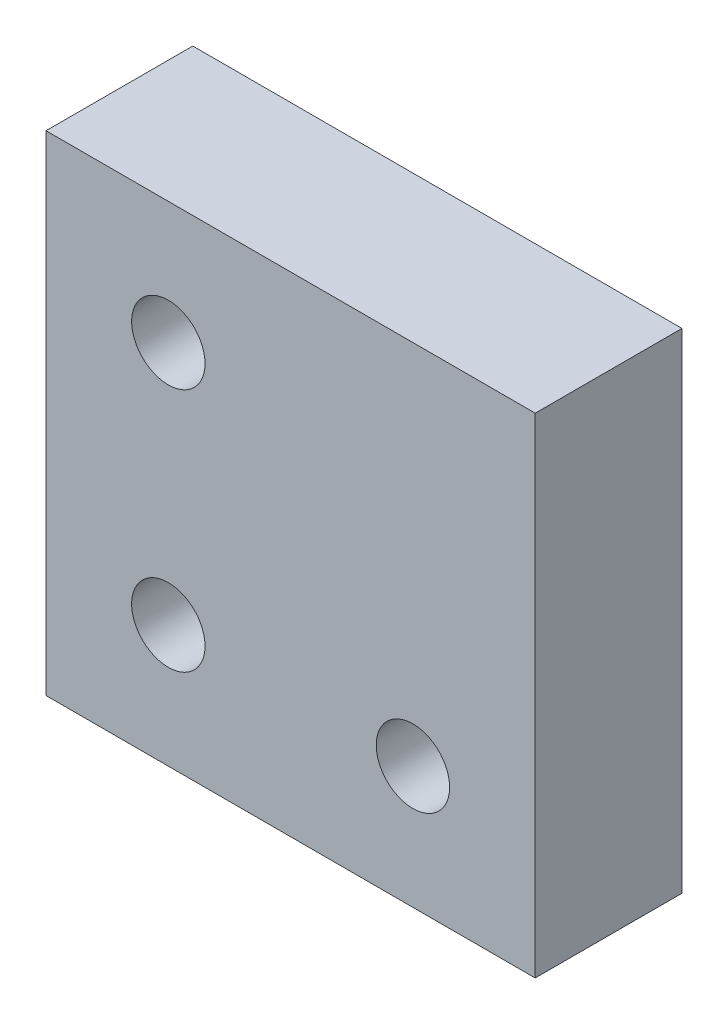
ISO-10303-21;
HEADER;
FILE_DESCRIPTION(('STEP AP214'),'2;1');
FILE_NAME('part.step','',(''),(''),'','','');
FILE_SCHEMA(('AUTOMOTIVE_DESIGN { 1 0 10303 214 1 1 1 1 }'));
ENDSEC;
DATA;
#1=APPLICATION_CONTEXT('core data for automotive mechanical design processes');
#2=APPLICATION_PROTOCOL_DEFINITION('international standard','automotive_design',2000,#1);
#3=PRODUCT_CONTEXT('',#1,'mechanical');
#4=PRODUCT('Part','Part','',(#3));
#5=PRODUCT_RELATED_PRODUCT_CATEGORY('part','',(#4));
#6=PRODUCT_DEFINITION_FORMATION('','',#4);
#7=PRODUCT_DEFINITION_CONTEXT('part definition',#1,'design');
#8=PRODUCT_DEFINITION('design','',#6,#7);
#9=PRODUCT_DEFINITION_SHAPE('','',#8);
#10=(LENGTH_UNIT() NAMED_UNIT(*) SI_UNIT(.MILLI.,.METRE.));
#11=(NAMED_UNIT(*) PLANE_ANGLE_UNIT() SI_UNIT($,.RADIAN.));
#12=(NAMED_UNIT(*) SI_UNIT($,.STERADIAN.) SOLID_ANGLE_UNIT());
#13=UNCERTAINTY_MEASURE_WITH_UNIT(LENGTH_MEASURE(1.E-05),#10,'distance_accuracy_value','');
#14=(GEOMETRIC_REPRESENTATION_CONTEXT(3) GLOBAL_UNCERTAINTY_ASSIGNED_CONTEXT((#13)) GLOBAL_UNIT_ASSIGNED_CONTEXT((#10,
#11,#12)) REPRESENTATION_CONTEXT('',''));
#15=CARTESIAN_POINT('',(0.,0.,0.));
#16=DIRECTION('',(0.,0.,1.));
#17=DIRECTION('',(1.,0.,0.));
#18=AXIS2_PLACEMENT_3D('',#15,#16,#17);
#19=CARTESIAN_POINT('',(-10.,10.,6.));
#20=DIRECTION('',(1.,0.,0.));
#21=DIRECTION('',(0.,1.,0.));
#22=AXIS2_PLACEMENT_3D('',#19,#20,#21);
#23=PLANE('',#22);
#24=DIRECTION('',(0.,-1.,0.));
#25=VECTOR('',#24,1.);
#26=CARTESIAN_POINT('',(-10.,10.,0.));
#27=LINE('',#26,#25);
#28=CARTESIAN_POINT('',(-10.,10.,0.));
#29=VERTEX_POINT('',#28);
#30=CARTESIAN_POINT('',(-10.,-10.,0.));
#31=VERTEX_POINT('',#30);
#32=EDGE_CURVE('E96',#29,#31,#27,.T.);
#33=ORIENTED_EDGE('',*,*,#32,.T.);
#34=DIRECTION('',(0.,0.,-1.));
#35=VECTOR('',#34,1.);
#36=CARTESIAN_POINT('',(-10.,-10.,6.));
#37=LINE('',#36,#35);
#38=CARTESIAN_POINT('',(-10.,-10.,6.));
#39=VERTEX_POINT('',#38);
#40=EDGE_CURVE('E11',#39,#31,#37,.T.);
#41=ORIENTED_EDGE('',*,*,#40,.F.);
#42=DIRECTION('',(0.,-1.,0.));
#43=VECTOR('',#42,1.);
#44=CARTESIAN_POINT('',(-10.,10.,6.));
#45=LINE('',#44,#43);
#46=CARTESIAN_POINT('',(-10.,10.,6.));
#47=VERTEX_POINT('',#46);
#48=EDGE_CURVE('E84',#47,#39,#45,.T.);
#49=ORIENTED_EDGE('',*,*,#48,.F.);
#50=DIRECTION('',(0.,0.,-1.));
#51=VECTOR('',#50,1.);
#52=CARTESIAN_POINT('',(-10.,10.,6.));
#53=LINE('',#52,#51);
#54=EDGE_CURVE('E92',#47,#29,#53,.T.);
#55=ORIENTED_EDGE('',*,*,#54,.T.);
#56=EDGE_LOOP('',(#33,#41,#49,#55));
#57=FACE_BOUND('',#56,.T.);
#58=ADVANCED_FACE('F33',(#57),#23,.F.);
#59=CARTESIAN_POINT('',(-10.,-10.,6.));
#60=DIRECTION('',(0.,1.,0.));
#61=DIRECTION('',(0.,0.,1.));
#62=AXIS2_PLACEMENT_3D('',#59,#60,#61);
#63=PLANE('',#62);
#64=DIRECTION('',(1.,0.,0.));
#65=VECTOR('',#64,1.);
#66=CARTESIAN_POINT('',(-10.,-10.,0.));
#67=LINE('',#66,#65);
#68=CARTESIAN_POINT('',(10.,-10.,0.));
#69=VERTEX_POINT('',#68);
#70=EDGE_CURVE('E88',#31,#69,#67,.T.);
#71=ORIENTED_EDGE('',*,*,#70,.T.);
#72=DIRECTION('',(0.,0.,-1.));
#73=VECTOR('',#72,1.);
#74=CARTESIAN_POINT('',(10.,-10.,6.));
#75=LINE('',#74,#73);
#76=CARTESIAN_POINT('',(10.,-10.,6.));
#77=VERTEX_POINT('',#76);
#78=EDGE_CURVE('E41',#77,#69,#75,.T.);
#79=ORIENTED_EDGE('',*,*,#78,.F.);
#80=DIRECTION('',(1.,0.,0.));
#81=VECTOR('',#80,1.);
#82=CARTESIAN_POINT('',(-10.,-10.,6.));
#83=LINE('',#82,#81);
#84=EDGE_CURVE('E79',#39,#77,#83,.T.);
#85=ORIENTED_EDGE('',*,*,#84,.F.);
#86=ORIENTED_EDGE('',*,*,#40,.T.);
#87=EDGE_LOOP('',(#71,#79,#85,#86));
#88=FACE_BOUND('',#87,.T.);
#89=ADVANCED_FACE('F87',(#88),#63,.F.);
#90=CARTESIAN_POINT('',(10.,10.,6.));
#91=DIRECTION('',(-1.,0.,0.));
#92=DIRECTION('',(0.,-1.,0.));
#93=AXIS2_PLACEMENT_3D('',#90,#91,#92);
#94=PLANE('',#93);
#95=DIRECTION('',(0.,1.,0.));
#96=VECTOR('',#95,1.);
#97=CARTESIAN_POINT('',(10.,10.,0.));
#98=LINE('',#97,#96);
#99=CARTESIAN_POINT('',(10.,10.,0.));
#100=VERTEX_POINT('',#99);
#101=EDGE_CURVE('E66',#69,#100,#98,.T.);
#102=ORIENTED_EDGE('',*,*,#101,.T.);
#103=DIRECTION('',(0.,0.,-1.));
#104=VECTOR('',#103,1.);
#105=CARTESIAN_POINT('',(10.,10.,6.));
#106=LINE('',#105,#104);
#107=CARTESIAN_POINT('',(10.,10.,6.));
#108=VERTEX_POINT('',#107);
#109=EDGE_CURVE('E89',#108,#100,#106,.T.);
#110=ORIENTED_EDGE('',*,*,#109,.F.);
#111=DIRECTION('',(0.,1.,0.));
#112=VECTOR('',#111,1.);
#113=CARTESIAN_POINT('',(10.,10.,6.));
#114=LINE('',#113,#112);
#115=EDGE_CURVE('E82',#77,#108,#114,.T.);
#116=ORIENTED_EDGE('',*,*,#115,.F.);
#117=ORIENTED_EDGE('',*,*,#78,.T.);
#118=EDGE_LOOP('',(#102,#110,#116,#117));
#119=FACE_BOUND('',#118,.T.);
#120=ADVANCED_FACE('F90',(#119),#94,.F.);
#121=CARTESIAN_POINT('',(-10.,10.,6.));
#122=DIRECTION('',(0.,-1.,0.));
#123=DIRECTION('',(0.,0.,-1.));
#124=AXIS2_PLACEMENT_3D('',#121,#122,#123);
#125=PLANE('',#124);
#126=DIRECTION('',(-1.,0.,0.));
#127=VECTOR('',#126,1.);
#128=CARTESIAN_POINT('',(-10.,10.,0.));
#129=LINE('',#128,#127);
#130=EDGE_CURVE('E72',#100,#29,#129,.T.);
#131=ORIENTED_EDGE('',*,*,#130,.T.);
#132=ORIENTED_EDGE('',*,*,#54,.F.);
#133=DIRECTION('',(-1.,0.,0.));
#134=VECTOR('',#133,1.);
#135=CARTESIAN_POINT('',(-10.,10.,6.));
#136=LINE('',#135,#134);
#137=EDGE_CURVE('E49',#108,#47,#136,.T.);
#138=ORIENTED_EDGE('',*,*,#137,.F.);
#139=ORIENTED_EDGE('',*,*,#109,.T.);
#140=EDGE_LOOP('',(#131,#132,#138,#139));
#141=FACE_BOUND('',#140,.T.);
#142=ADVANCED_FACE('F104',(#141),#125,.F.);
#143=CARTESIAN_POINT('',(0.,0.,6.));
#144=DIRECTION('',(0.,0.,1.));
#145=DIRECTION('',(1.,0.,0.));
#146=AXIS2_PLACEMENT_3D('',#143,#144,#145);
#147=PLANE('',#146);
#148=CARTESIAN_POINT('',(5.,-5.,6.));
#149=DIRECTION('',(0.,0.,1.));
#150=DIRECTION('',(1.,0.,0.));
#151=AXIS2_PLACEMENT_3D('',#148,#149,#150);
#152=CIRCLE('',#151,1.5);
#153=CARTESIAN_POINT('',(6.5,-5.,6.));
#154=VERTEX_POINT('',#153);
#155=EDGE_CURVE('E122',#154,#154,#152,.T.);
#156=ORIENTED_EDGE('',*,*,#155,.F.);
#157=EDGE_LOOP('',(#156));
#158=FACE_BOUND('',#157,.T.);
#159=CARTESIAN_POINT('',(-5.,-5.,6.));
#160=DIRECTION('',(0.,0.,1.));
#161=DIRECTION('',(1.,0.,0.));
#162=AXIS2_PLACEMENT_3D('',#159,#160,#161);
#163=CIRCLE('',#162,1.5);
#164=CARTESIAN_POINT('',(-3.5,-5.,6.));
#165=VERTEX_POINT('',#164);
#166=EDGE_CURVE('E116',#165,#165,#163,.T.);
#167=ORIENTED_EDGE('',*,*,#166,.F.);
#168=EDGE_LOOP('',(#167));
#169=FACE_BOUND('',#168,.T.);
#170=CARTESIAN_POINT('',(-5.,5.,6.));
#171=DIRECTION('',(0.,0.,1.));
#172=DIRECTION('',(1.,0.,0.));
#173=AXIS2_PLACEMENT_3D('',#170,#171,#172);
#174=CIRCLE('',#173,1.5);
#175=CARTESIAN_POINT('',(-3.5,5.,6.));
#176=VERTEX_POINT('',#175);
#177=EDGE_CURVE('E110',#176,#176,#174,.T.);
#178=ORIENTED_EDGE('',*,*,#177,.F.);
#179=EDGE_LOOP('',(#178));
#180=FACE_BOUND('',#179,.T.);
#181=ORIENTED_EDGE('',*,*,#48,.T.);
#182=ORIENTED_EDGE('',*,*,#84,.T.);
#183=ORIENTED_EDGE('',*,*,#115,.T.);
#184=ORIENTED_EDGE('',*,*,#137,.T.);
#185=EDGE_LOOP('',(#181,#182,#183,#184));
#186=FACE_BOUND('',#185,.T.);
#187=ADVANCED_FACE('F80',(#158,#169,#180,#186),#147,.T.);
#188=CARTESIAN_POINT('',(0.,0.,0.));
#189=DIRECTION('',(0.,0.,1.));
#190=DIRECTION('',(1.,0.,0.));
#191=AXIS2_PLACEMENT_3D('',#188,#189,#190);
#192=PLANE('',#191);
#193=CARTESIAN_POINT('',(5.,-5.,0.));
#194=DIRECTION('',(0.,0.,1.));
#195=DIRECTION('',(1.,0.,0.));
#196=AXIS2_PLACEMENT_3D('',#193,#194,#195);
#197=CIRCLE('',#196,1.5);
#198=CARTESIAN_POINT('',(6.5,-5.,0.));
#199=VERTEX_POINT('',#198);
#200=EDGE_CURVE('E119',#199,#199,#197,.T.);
#201=ORIENTED_EDGE('',*,*,#200,.T.);
#202=EDGE_LOOP('',(#201));
#203=FACE_BOUND('',#202,.T.);
#204=CARTESIAN_POINT('',(-5.,-5.,0.));
#205=DIRECTION('',(0.,0.,1.));
#206=DIRECTION('',(1.,0.,0.));
#207=AXIS2_PLACEMENT_3D('',#204,#205,#206);
#208=CIRCLE('',#207,1.5);
#209=CARTESIAN_POINT('',(-3.5,-5.,0.));
#210=VERTEX_POINT('',#209);
#211=EDGE_CURVE('E113',#210,#210,#208,.T.);
#212=ORIENTED_EDGE('',*,*,#211,.T.);
#213=EDGE_LOOP('',(#212));
#214=FACE_BOUND('',#213,.T.);
#215=CARTESIAN_POINT('',(-5.,5.,0.));
#216=DIRECTION('',(0.,0.,1.));
#217=DIRECTION('',(1.,0.,0.));
#218=AXIS2_PLACEMENT_3D('',#215,#216,#217);
#219=CIRCLE('',#218,1.5);
#220=CARTESIAN_POINT('',(-3.5,5.,0.));
#221=VERTEX_POINT('',#220);
#222=EDGE_CURVE('E99',#221,#221,#219,.T.);
#223=ORIENTED_EDGE('',*,*,#222,.T.);
#224=EDGE_LOOP('',(#223));
#225=FACE_BOUND('',#224,.T.);
#226=ORIENTED_EDGE('',*,*,#32,.F.);
#227=ORIENTED_EDGE('',*,*,#130,.F.);
#228=ORIENTED_EDGE('',*,*,#101,.F.);
#229=ORIENTED_EDGE('',*,*,#70,.F.);
#230=EDGE_LOOP('',(#226,#227,#228,#229));
#231=FACE_BOUND('',#230,.T.);
#232=ADVANCED_FACE('F107',(#203,#214,#225,#231),#192,.F.);
#233=CARTESIAN_POINT('',(-5.,5.,0.));
#234=DIRECTION('',(0.,0.,1.));
#235=DIRECTION('',(1.,0.,0.));
#236=AXIS2_PLACEMENT_3D('',#233,#234,#235);
#237=CYLINDRICAL_SURFACE('',#236,1.5);
#238=ORIENTED_EDGE('',*,*,#222,.F.);
#239=EDGE_LOOP('',(#238));
#240=FACE_BOUND('',#239,.T.);
#241=ORIENTED_EDGE('',*,*,#177,.T.);
#242=EDGE_LOOP('',(#241));
#243=FACE_BOUND('',#242,.T.);
#244=ADVANCED_FACE('F144',(#240,#243),#237,.F.);
#245=CARTESIAN_POINT('',(-5.,-5.,0.));
#246=DIRECTION('',(0.,0.,1.));
#247=DIRECTION('',(1.,0.,0.));
#248=AXIS2_PLACEMENT_3D('',#245,#246,#247);
#249=CYLINDRICAL_SURFACE('',#248,1.5);
#250=ORIENTED_EDGE('',*,*,#211,.F.);
#251=EDGE_LOOP('',(#250));
#252=FACE_BOUND('',#251,.T.);
#253=ORIENTED_EDGE('',*,*,#166,.T.);
#254=EDGE_LOOP('',(#253));
#255=FACE_BOUND('',#254,.T.);
#256=ADVANCED_FACE('F133',(#252,#255),#249,.F.);
#257=CARTESIAN_POINT('',(5.,-5.,0.));
#258=DIRECTION('',(0.,0.,1.));
#259=DIRECTION('',(1.,0.,0.));
#260=AXIS2_PLACEMENT_3D('',#257,#258,#259);
#261=CYLINDRICAL_SURFACE('',#260,1.5);
#262=ORIENTED_EDGE('',*,*,#200,.F.);
#263=EDGE_LOOP('',(#262));
#264=FACE_BOUND('',#263,.T.);
#265=ORIENTED_EDGE('',*,*,#155,.T.);
#266=EDGE_LOOP('',(#265));
#267=FACE_BOUND('',#266,.T.);
#268=ADVANCED_FACE('F130',(#264,#267),#261,.F.);
#269=CLOSED_SHELL('',(#58,#89,#120,#142,#187,#232,#244,#256,#268));
#270=MANIFOLD_SOLID_BREP('B2',#269);
#271=ADVANCED_BREP_SHAPE_REPRESENTATION('',(#18,#270),#14);
#272=SHAPE_DEFINITION_REPRESENTATION(#9,#271);
ENDSEC;
END-ISO-10303-21;
